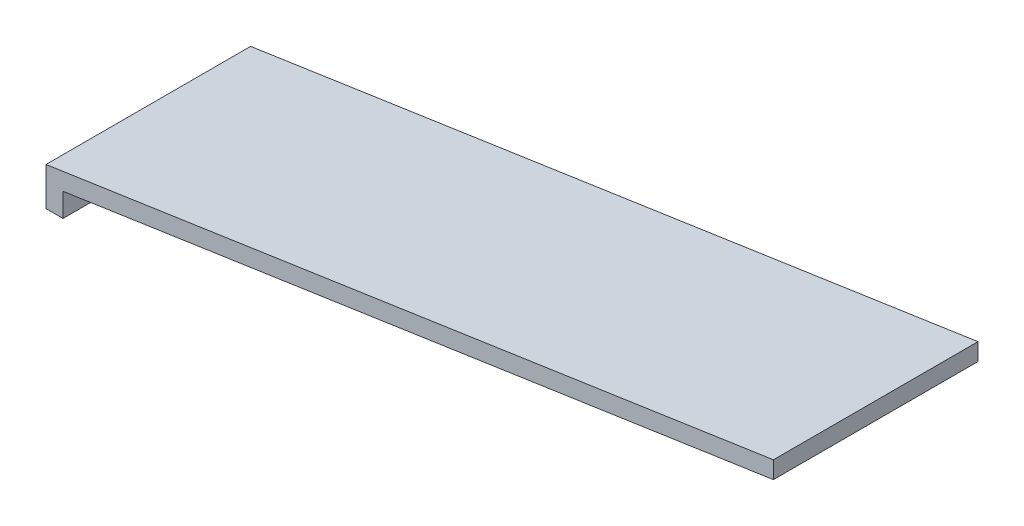
ISO-10303-21;
HEADER;
FILE_DESCRIPTION(('STEP AP214'),'2;1');
FILE_NAME('part.step','',(''),(''),'','','');
FILE_SCHEMA(('AUTOMOTIVE_DESIGN { 1 0 10303 214 1 1 1 1 }'));
ENDSEC;
DATA;
#1=APPLICATION_CONTEXT('core data for automotive mechanical design processes');
#2=APPLICATION_PROTOCOL_DEFINITION('international standard','automotive_design',2000,#1);
#3=PRODUCT_CONTEXT('',#1,'mechanical');
#4=PRODUCT('Part','Part','',(#3));
#5=PRODUCT_RELATED_PRODUCT_CATEGORY('part','',(#4));
#6=PRODUCT_DEFINITION_FORMATION('','',#4);
#7=PRODUCT_DEFINITION_CONTEXT('part definition',#1,'design');
#8=PRODUCT_DEFINITION('design','',#6,#7);
#9=PRODUCT_DEFINITION_SHAPE('','',#8);
#10=(LENGTH_UNIT() NAMED_UNIT(*) SI_UNIT(.MILLI.,.METRE.));
#11=(NAMED_UNIT(*) PLANE_ANGLE_UNIT() SI_UNIT($,.RADIAN.));
#12=(NAMED_UNIT(*) SI_UNIT($,.STERADIAN.) SOLID_ANGLE_UNIT());
#13=UNCERTAINTY_MEASURE_WITH_UNIT(LENGTH_MEASURE(1.E-05),#10,'distance_accuracy_value','');
#14=(GEOMETRIC_REPRESENTATION_CONTEXT(3) GLOBAL_UNCERTAINTY_ASSIGNED_CONTEXT((#13)) GLOBAL_UNIT_ASSIGNED_CONTEXT((#10,
#11,#12)) REPRESENTATION_CONTEXT('',''));
#15=CARTESIAN_POINT('',(0.,0.,0.));
#16=DIRECTION('',(0.,0.,1.));
#17=DIRECTION('',(1.,0.,0.));
#18=AXIS2_PLACEMENT_3D('',#15,#16,#17);
#19=CARTESIAN_POINT('',(12.,2.29293821747763,-1.45));
#20=DIRECTION('',(-0.146828724135006,0.989161931014779,0.));
#21=DIRECTION('',(-0.989161931014779,-0.146828724135006,0.));
#22=AXIS2_PLACEMENT_3D('',#19,#20,#21);
#23=PLANE('',#22);
#24=DIRECTION('',(-0.989161931014779,-0.146828724135006,0.));
#25=VECTOR('',#24,1.);
#26=CARTESIAN_POINT('',(12.,2.29293821747763,2.15));
#27=LINE('',#26,#25);
#28=CARTESIAN_POINT('',(12.,2.29293821747763,2.15));
#29=VERTEX_POINT('',#28);
#30=CARTESIAN_POINT('',(-0.799999999999998,0.392938217477634,2.15));
#31=VERTEX_POINT('',#30);
#32=EDGE_CURVE('E117',#29,#31,#27,.T.);
#33=ORIENTED_EDGE('',*,*,#32,.F.);
#34=DIRECTION('',(0.,0.,1.));
#35=VECTOR('',#34,1.);
#36=CARTESIAN_POINT('',(12.,2.29293821747763,-1.45));
#37=LINE('',#36,#35);
#38=CARTESIAN_POINT('',(12.,2.29293821747763,-1.45));
#39=VERTEX_POINT('',#38);
#40=EDGE_CURVE('E11',#39,#29,#37,.T.);
#41=ORIENTED_EDGE('',*,*,#40,.F.);
#42=DIRECTION('',(-0.989161931014779,-0.146828724135006,0.));
#43=VECTOR('',#42,1.);
#44=CARTESIAN_POINT('',(12.,2.29293821747763,-1.45));
#45=LINE('',#44,#43);
#46=CARTESIAN_POINT('',(-0.799999999999998,0.392938217477634,-1.45));
#47=VERTEX_POINT('',#46);
#48=EDGE_CURVE('E131',#39,#47,#45,.T.);
#49=ORIENTED_EDGE('',*,*,#48,.T.);
#50=DIRECTION('',(0.,0.,1.));
#51=VECTOR('',#50,1.);
#52=CARTESIAN_POINT('',(-0.799999999999998,0.392938217477634,-1.45));
#53=LINE('',#52,#51);
#54=EDGE_CURVE('E35',#47,#31,#53,.T.);
#55=ORIENTED_EDGE('',*,*,#54,.T.);
#56=EDGE_LOOP('',(#33,#41,#49,#55));
#57=FACE_BOUND('',#56,.T.);
#58=ADVANCED_FACE('F32',(#57),#23,.T.);
#59=CARTESIAN_POINT('',(12.,2.29293821747763,-1.45));
#60=DIRECTION('',(1.,0.,0.));
#61=DIRECTION('',(0.,0.,-1.));
#62=AXIS2_PLACEMENT_3D('',#59,#60,#61);
#63=PLANE('',#62);
#64=DIRECTION('',(0.,1.,0.));
#65=VECTOR('',#64,1.);
#66=CARTESIAN_POINT('',(12.,2.29293821747763,2.15));
#67=LINE('',#66,#65);
#68=CARTESIAN_POINT('',(12.,1.98965117155156,2.15));
#69=VERTEX_POINT('',#68);
#70=EDGE_CURVE('E129',#69,#29,#67,.T.);
#71=ORIENTED_EDGE('',*,*,#70,.F.);
#72=DIRECTION('',(0.,0.,1.));
#73=VECTOR('',#72,1.);
#74=CARTESIAN_POINT('',(12.,1.98965117155156,-1.45));
#75=LINE('',#74,#73);
#76=CARTESIAN_POINT('',(12.,1.98965117155156,-1.45));
#77=VERTEX_POINT('',#76);
#78=EDGE_CURVE('E41',#77,#69,#75,.T.);
#79=ORIENTED_EDGE('',*,*,#78,.F.);
#80=DIRECTION('',(0.,1.,0.));
#81=VECTOR('',#80,1.);
#82=CARTESIAN_POINT('',(12.,2.29293821747763,-1.45));
#83=LINE('',#82,#81);
#84=EDGE_CURVE('E107',#77,#39,#83,.T.);
#85=ORIENTED_EDGE('',*,*,#84,.T.);
#86=ORIENTED_EDGE('',*,*,#40,.T.);
#87=EDGE_LOOP('',(#71,#79,#85,#86));
#88=FACE_BOUND('',#87,.T.);
#89=ADVANCED_FACE('F139',(#88),#63,.T.);
#90=CARTESIAN_POINT('',(12.,1.98965117155156,-1.45));
#91=DIRECTION('',(0.146828724135006,-0.989161931014779,0.));
#92=DIRECTION('',(0.989161931014779,0.146828724135006,0.));
#93=AXIS2_PLACEMENT_3D('',#90,#91,#92);
#94=PLANE('',#93);
#95=DIRECTION('',(0.989161931014779,0.146828724135006,0.));
#96=VECTOR('',#95,1.);
#97=CARTESIAN_POINT('',(12.,1.98965117155156,2.15));
#98=LINE('',#97,#96);
#99=CARTESIAN_POINT('',(-0.499999999999997,0.134182421551563,2.15));
#100=VERTEX_POINT('',#99);
#101=EDGE_CURVE('E94',#100,#69,#98,.T.);
#102=ORIENTED_EDGE('',*,*,#101,.F.);
#103=DIRECTION('',(0.,0.,1.));
#104=VECTOR('',#103,1.);
#105=CARTESIAN_POINT('',(-0.499999999999997,0.134182421551563,-1.45));
#106=LINE('',#105,#104);
#107=CARTESIAN_POINT('',(-0.499999999999997,0.134182421551563,-1.45));
#108=VERTEX_POINT('',#107);
#109=EDGE_CURVE('E89',#108,#100,#106,.T.);
#110=ORIENTED_EDGE('',*,*,#109,.F.);
#111=DIRECTION('',(0.989161931014779,0.146828724135006,0.));
#112=VECTOR('',#111,1.);
#113=CARTESIAN_POINT('',(12.,1.98965117155156,-1.45));
#114=LINE('',#113,#112);
#115=EDGE_CURVE('E92',#108,#77,#114,.T.);
#116=ORIENTED_EDGE('',*,*,#115,.T.);
#117=ORIENTED_EDGE('',*,*,#78,.T.);
#118=EDGE_LOOP('',(#102,#110,#116,#117));
#119=FACE_BOUND('',#118,.T.);
#120=ADVANCED_FACE('F91',(#119),#94,.T.);
#121=CARTESIAN_POINT('',(-0.499999999999998,-0.280061782522364,-1.45));
#122=DIRECTION('',(1.,0.,0.));
#123=DIRECTION('',(0.,1.,0.));
#124=AXIS2_PLACEMENT_3D('',#121,#122,#123);
#125=PLANE('',#124);
#126=DIRECTION('',(0.,1.,0.));
#127=VECTOR('',#126,1.);
#128=CARTESIAN_POINT('',(-0.499999999999998,-0.280061782522364,2.15));
#129=LINE('',#128,#127);
#130=CARTESIAN_POINT('',(-0.499999999999998,-0.280061782522364,2.15));
#131=VERTEX_POINT('',#130);
#132=EDGE_CURVE('E126',#131,#100,#129,.T.);
#133=ORIENTED_EDGE('',*,*,#132,.F.);
#134=DIRECTION('',(0.,0.,1.));
#135=VECTOR('',#134,1.);
#136=CARTESIAN_POINT('',(-0.499999999999998,-0.280061782522364,-1.45));
#137=LINE('',#136,#135);
#138=CARTESIAN_POINT('',(-0.499999999999998,-0.280061782522364,-1.45));
#139=VERTEX_POINT('',#138);
#140=EDGE_CURVE('E99',#139,#131,#137,.T.);
#141=ORIENTED_EDGE('',*,*,#140,.F.);
#142=DIRECTION('',(0.,1.,0.));
#143=VECTOR('',#142,1.);
#144=CARTESIAN_POINT('',(-0.499999999999998,-0.280061782522364,-1.45));
#145=LINE('',#144,#143);
#146=EDGE_CURVE('E105',#139,#108,#145,.T.);
#147=ORIENTED_EDGE('',*,*,#146,.T.);
#148=ORIENTED_EDGE('',*,*,#109,.T.);
#149=EDGE_LOOP('',(#133,#141,#147,#148));
#150=FACE_BOUND('',#149,.T.);
#151=ADVANCED_FACE('F109',(#150),#125,.T.);
#152=CARTESIAN_POINT('',(-0.799999999999998,-0.280061782522364,-1.45));
#153=DIRECTION('',(0.,-1.,0.));
#154=DIRECTION('',(1.,0.,0.));
#155=AXIS2_PLACEMENT_3D('',#152,#153,#154);
#156=PLANE('',#155);
#157=DIRECTION('',(1.,0.,0.));
#158=VECTOR('',#157,1.);
#159=CARTESIAN_POINT('',(-0.799999999999998,-0.280061782522364,2.15));
#160=LINE('',#159,#158);
#161=CARTESIAN_POINT('',(-0.799999999999998,-0.280061782522364,2.15));
#162=VERTEX_POINT('',#161);
#163=EDGE_CURVE('E123',#162,#131,#160,.T.);
#164=ORIENTED_EDGE('',*,*,#163,.F.);
#165=DIRECTION('',(0.,0.,1.));
#166=VECTOR('',#165,1.);
#167=CARTESIAN_POINT('',(-0.799999999999998,-0.280061782522364,-1.45));
#168=LINE('',#167,#166);
#169=CARTESIAN_POINT('',(-0.799999999999998,-0.280061782522364,-1.45));
#170=VERTEX_POINT('',#169);
#171=EDGE_CURVE('E134',#170,#162,#168,.T.);
#172=ORIENTED_EDGE('',*,*,#171,.F.);
#173=DIRECTION('',(1.,0.,0.));
#174=VECTOR('',#173,1.);
#175=CARTESIAN_POINT('',(-0.799999999999998,-0.280061782522364,-1.45));
#176=LINE('',#175,#174);
#177=EDGE_CURVE('E110',#170,#139,#176,.T.);
#178=ORIENTED_EDGE('',*,*,#177,.T.);
#179=ORIENTED_EDGE('',*,*,#140,.T.);
#180=EDGE_LOOP('',(#164,#172,#178,#179));
#181=FACE_BOUND('',#180,.T.);
#182=ADVANCED_FACE('F152',(#181),#156,.T.);
#183=CARTESIAN_POINT('',(-0.799999999999998,0.392938217477634,-1.45));
#184=DIRECTION('',(-1.,0.,0.));
#185=DIRECTION('',(0.,-1.,0.));
#186=AXIS2_PLACEMENT_3D('',#183,#184,#185);
#187=PLANE('',#186);
#188=DIRECTION('',(0.,-1.,0.));
#189=VECTOR('',#188,1.);
#190=CARTESIAN_POINT('',(-0.799999999999998,0.392938217477634,2.15));
#191=LINE('',#190,#189);
#192=EDGE_CURVE('E120',#31,#162,#191,.T.);
#193=ORIENTED_EDGE('',*,*,#192,.F.);
#194=ORIENTED_EDGE('',*,*,#54,.F.);
#195=DIRECTION('',(0.,-1.,0.));
#196=VECTOR('',#195,1.);
#197=CARTESIAN_POINT('',(-0.799999999999998,0.392938217477634,-1.45));
#198=LINE('',#197,#196);
#199=EDGE_CURVE('E112',#47,#170,#198,.T.);
#200=ORIENTED_EDGE('',*,*,#199,.T.);
#201=ORIENTED_EDGE('',*,*,#171,.T.);
#202=EDGE_LOOP('',(#193,#194,#200,#201));
#203=FACE_BOUND('',#202,.T.);
#204=ADVANCED_FACE('F136',(#203),#187,.T.);
#205=CARTESIAN_POINT('',(0.,0.,-1.45));
#206=DIRECTION('',(0.,0.,1.));
#207=DIRECTION('',(1.,0.,0.));
#208=AXIS2_PLACEMENT_3D('',#205,#206,#207);
#209=PLANE('',#208);
#210=ORIENTED_EDGE('',*,*,#48,.F.);
#211=ORIENTED_EDGE('',*,*,#84,.F.);
#212=ORIENTED_EDGE('',*,*,#115,.F.);
#213=ORIENTED_EDGE('',*,*,#146,.F.);
#214=ORIENTED_EDGE('',*,*,#177,.F.);
#215=ORIENTED_EDGE('',*,*,#199,.F.);
#216=EDGE_LOOP('',(#210,#211,#212,#213,#214,#215));
#217=FACE_BOUND('',#216,.T.);
#218=ADVANCED_FACE('F103',(#217),#209,.F.);
#219=CARTESIAN_POINT('',(0.,0.,2.15));
#220=DIRECTION('',(0.,0.,1.));
#221=DIRECTION('',(1.,0.,0.));
#222=AXIS2_PLACEMENT_3D('',#219,#220,#221);
#223=PLANE('',#222);
#224=ORIENTED_EDGE('',*,*,#32,.T.);
#225=ORIENTED_EDGE('',*,*,#192,.T.);
#226=ORIENTED_EDGE('',*,*,#163,.T.);
#227=ORIENTED_EDGE('',*,*,#132,.T.);
#228=ORIENTED_EDGE('',*,*,#101,.T.);
#229=ORIENTED_EDGE('',*,*,#70,.T.);
#230=EDGE_LOOP('',(#224,#225,#226,#227,#228,#229));
#231=FACE_BOUND('',#230,.T.);
#232=ADVANCED_FACE('F138',(#231),#223,.T.);
#233=CLOSED_SHELL('',(#58,#89,#120,#151,#182,#204,#218,#232));
#234=MANIFOLD_SOLID_BREP('B2',#233);
#235=ADVANCED_BREP_SHAPE_REPRESENTATION('',(#18,#234),#14);
#236=SHAPE_DEFINITION_REPRESENTATION(#9,#235);
ENDSEC;
END-ISO-10303-21;
